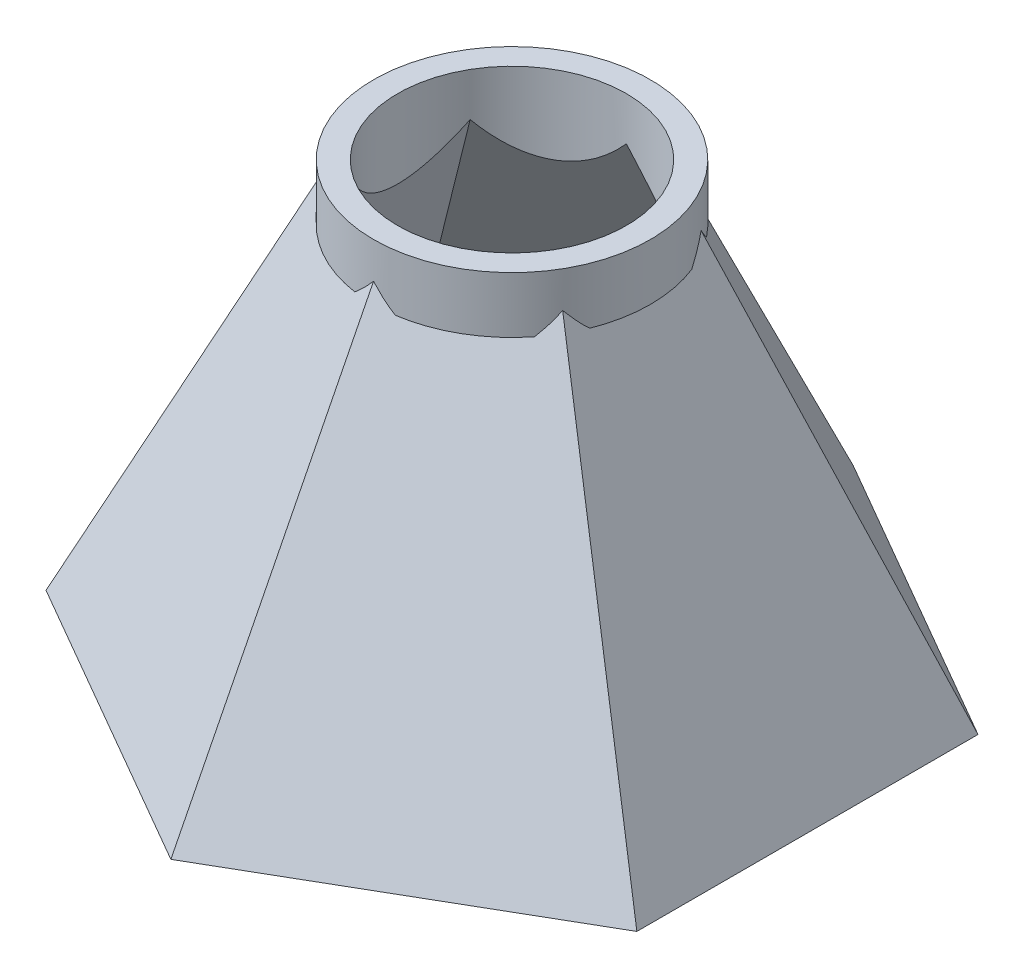
ISO-10303-21;
HEADER;
FILE_DESCRIPTION(('STEP AP214'),'2;1');
FILE_NAME('part.step','',(''),(''),'','','');
FILE_SCHEMA(('AUTOMOTIVE_DESIGN { 1 0 10303 214 1 1 1 1 }'));
ENDSEC;
DATA;
#1=APPLICATION_CONTEXT('core data for automotive mechanical design processes');
#2=APPLICATION_PROTOCOL_DEFINITION('international standard','automotive_design',2000,#1);
#3=PRODUCT_CONTEXT('',#1,'mechanical');
#4=PRODUCT('Part','Part','',(#3));
#5=PRODUCT_RELATED_PRODUCT_CATEGORY('part','',(#4));
#6=PRODUCT_DEFINITION_FORMATION('','',#4);
#7=PRODUCT_DEFINITION_CONTEXT('part definition',#1,'design');
#8=PRODUCT_DEFINITION('design','',#6,#7);
#9=PRODUCT_DEFINITION_SHAPE('','',#8);
#10=(LENGTH_UNIT() NAMED_UNIT(*) SI_UNIT(.MILLI.,.METRE.));
#11=(NAMED_UNIT(*) PLANE_ANGLE_UNIT() SI_UNIT($,.RADIAN.));
#12=(NAMED_UNIT(*) SI_UNIT($,.STERADIAN.) SOLID_ANGLE_UNIT());
#13=UNCERTAINTY_MEASURE_WITH_UNIT(LENGTH_MEASURE(1.E-05),#10,'distance_accuracy_value','');
#14=(GEOMETRIC_REPRESENTATION_CONTEXT(3) GLOBAL_UNCERTAINTY_ASSIGNED_CONTEXT((#13)) GLOBAL_UNIT_ASSIGNED_CONTEXT((#10,
#11,#12)) REPRESENTATION_CONTEXT('',''));
#15=CARTESIAN_POINT('',(0.,0.,0.));
#16=DIRECTION('',(0.,0.,1.));
#17=DIRECTION('',(1.,0.,0.));
#18=AXIS2_PLACEMENT_3D('',#15,#16,#17);
#19=CARTESIAN_POINT('',(-13.1666408178174,55.118,-7.60176362048999));
#20=DIRECTION('',(-0.457729684734172,0.402410415934552,-0.792811070092072));
#21=DIRECTION('',(0.866025403784439,0.,-0.5));
#22=AXIS2_PLACEMENT_3D('',#19,#20,#21);
#23=PLANE('',#22);
#24=CARTESIAN_POINT('',(0.,85.0713119019853,0.));
#25=DIRECTION('',(-0.457729684734172,0.402410415934552,-0.792811070092072));
#26=DIRECTION('',(0.201205207967276,0.915459369468346,0.348497642946785));
#27=AXIS2_PLACEMENT_3D('',#24,#25,#26);
#28=ELLIPSE('',#27,43.5525505951377,17.526);
#29=CARTESIAN_POINT('',(0.,50.5423676594151,-17.526));
#30=VERTEX_POINT('',#29);
#31=CARTESIAN_POINT('',(-2.55384480948767,48.006,-17.3389317055306));
#32=VERTEX_POINT('',#31);
#33=EDGE_CURVE('E399',#30,#32,#28,.T.);
#34=ORIENTED_EDGE('',*,*,#33,.F.);
#35=DIRECTION('',(0.,-0.891709289939976,-0.452608597172815));
#36=VECTOR('',#35,1.);
#37=CARTESIAN_POINT('',(0.,27.559,-29.1917636204902));
#38=LINE('',#37,#36);
#39=CARTESIAN_POINT('',(0.,0.,-43.1800000000004));
#40=VERTEX_POINT('',#39);
#41=EDGE_CURVE('E412',#30,#40,#38,.T.);
#42=ORIENTED_EDGE('',*,*,#41,.T.);
#43=DIRECTION('',(0.866025403784438,0.,-0.500000000000001));
#44=VECTOR('',#43,1.);
#45=CARTESIAN_POINT('',(-18.6974884677062,0.,-32.3850000000003));
#46=LINE('',#45,#44);
#47=CARTESIAN_POINT('',(-37.3949769354125,0.,-21.5900000000001));
#48=VERTEX_POINT('',#47);
#49=EDGE_CURVE('E431',#48,#40,#46,.T.);
#50=ORIENTED_EDGE('',*,*,#49,.F.);
#51=DIRECTION('',(-0.391970543122896,-0.891709289939976,-0.226304298586406));
#52=VECTOR('',#51,1.);
#53=CARTESIAN_POINT('',(-25.2808088766149,27.559,-14.5958818102451));
#54=LINE('',#53,#52);
#55=CARTESIAN_POINT('',(-15.1779612267261,50.5423676594151,-8.763));
#56=VERTEX_POINT('',#55);
#57=EDGE_CURVE('E428',#56,#48,#54,.T.);
#58=ORIENTED_EDGE('',*,*,#57,.F.);
#59=CARTESIAN_POINT('',(-13.7390329267291,48.006,-10.8811603351046));
#60=VERTEX_POINT('',#59);
#61=EDGE_CURVE('E395',#60,#56,#28,.T.);
#62=ORIENTED_EDGE('',*,*,#61,.F.);
#63=DIRECTION('',(0.866025403784439,0.,-0.5));
#64=VECTOR('',#63,1.);
#65=CARTESIAN_POINT('',(-14.7297592770171,48.006,-10.3091642100726));
#66=LINE('',#65,#64);
#67=EDGE_CURVE('E388',#60,#32,#66,.T.);
#68=ORIENTED_EDGE('',*,*,#67,.T.);
#69=EDGE_LOOP('',(#34,#42,#50,#58,#62,#68));
#70=FACE_BOUND('',#69,.T.);
#71=ADVANCED_FACE('F195',(#70),#23,.T.);
#72=CARTESIAN_POINT('',(0.,55.118,-15.20352724098));
#73=DIRECTION('',(0.457729684734172,0.402410415934553,-0.792811070092071));
#74=DIRECTION('',(0.866025403784439,0.,0.5));
#75=AXIS2_PLACEMENT_3D('',#72,#73,#74);
#76=PLANE('',#75);
#77=CARTESIAN_POINT('',(0.,85.0713119019852,0.));
#78=DIRECTION('',(0.457729684734172,0.402410415934553,-0.792811070092071));
#79=DIRECTION('',(-0.201205207967276,0.915459369468345,0.348497642946785));
#80=AXIS2_PLACEMENT_3D('',#77,#78,#79);
#81=ELLIPSE('',#80,43.5525505951376,17.526);
#82=CARTESIAN_POINT('',(15.177961226726,50.5423676594151,-8.76300000000005));
#83=VERTEX_POINT('',#82);
#84=CARTESIAN_POINT('',(13.7390329267291,48.006,-10.8811603351046));
#85=VERTEX_POINT('',#84);
#86=EDGE_CURVE('E408',#83,#85,#81,.T.);
#87=ORIENTED_EDGE('',*,*,#86,.F.);
#88=DIRECTION('',(0.391970543122892,-0.891709289939976,-0.226304298586414));
#89=VECTOR('',#88,1.);
#90=CARTESIAN_POINT('',(25.2808088766148,27.559,-14.5958818102453));
#91=LINE('',#90,#89);
#92=CARTESIAN_POINT('',(37.3949769354122,0.,-21.5900000000006));
#93=VERTEX_POINT('',#92);
#94=EDGE_CURVE('E416',#83,#93,#91,.T.);
#95=ORIENTED_EDGE('',*,*,#94,.T.);
#96=DIRECTION('',(0.866025403784441,0.,0.499999999999995));
#97=VECTOR('',#96,1.);
#98=CARTESIAN_POINT('',(18.6974884677061,0.,-32.3850000000005));
#99=LINE('',#98,#97);
#100=EDGE_CURVE('E435',#40,#93,#99,.T.);
#101=ORIENTED_EDGE('',*,*,#100,.F.);
#102=ORIENTED_EDGE('',*,*,#41,.F.);
#103=CARTESIAN_POINT('',(2.55384480948768,48.006,-17.3389317055306));
#104=VERTEX_POINT('',#103);
#105=EDGE_CURVE('E411',#104,#30,#81,.T.);
#106=ORIENTED_EDGE('',*,*,#105,.F.);
#107=DIRECTION('',(0.866025403784439,0.,0.5));
#108=VECTOR('',#107,1.);
#109=CARTESIAN_POINT('',(1.56311845919968,48.006,-17.9109278305626));
#110=LINE('',#109,#108);
#111=EDGE_CURVE('E384',#104,#85,#110,.T.);
#112=ORIENTED_EDGE('',*,*,#111,.T.);
#113=EDGE_LOOP('',(#87,#95,#101,#102,#106,#112));
#114=FACE_BOUND('',#113,.T.);
#115=ADVANCED_FACE('F513',(#114),#76,.T.);
#116=CARTESIAN_POINT('',(13.1666408178174,55.118,-7.60176362048999));
#117=DIRECTION('',(0.915459369468346,0.40241041593455,0.));
#118=DIRECTION('',(0.,0.,1.));
#119=AXIS2_PLACEMENT_3D('',#116,#117,#118);
#120=PLANE('',#119);
#121=CARTESIAN_POINT('',(0.,85.0713119019855,0.));
#122=DIRECTION('',(0.915459369468346,0.40241041593455,0.));
#123=DIRECTION('',(-0.40241041593455,0.915459369468346,0.));
#124=AXIS2_PLACEMENT_3D('',#121,#122,#123);
#125=ELLIPSE('',#124,43.552550595138,17.526);
#126=CARTESIAN_POINT('',(15.1779612267261,50.5423676594151,8.76299999999998));
#127=VERTEX_POINT('',#126);
#128=CARTESIAN_POINT('',(16.2928777362167,48.006,6.457771370426));
#129=VERTEX_POINT('',#128);
#130=EDGE_CURVE('E404',#127,#129,#125,.T.);
#131=ORIENTED_EDGE('',*,*,#130,.F.);
#132=DIRECTION('',(0.391970543122899,-0.891709289939976,0.226304298586402));
#133=VECTOR('',#132,1.);
#134=CARTESIAN_POINT('',(25.280808876615,27.559,14.5958818102449));
#135=LINE('',#134,#133);
#136=CARTESIAN_POINT('',(37.3949769354126,0.,21.5899999999999));
#137=VERTEX_POINT('',#136);
#138=EDGE_CURVE('E419',#127,#137,#135,.T.);
#139=ORIENTED_EDGE('',*,*,#138,.T.);
#140=DIRECTION('',(0.,0.,1.));
#141=VECTOR('',#140,1.);
#142=CARTESIAN_POINT('',(37.3949769354124,0.,-3.81639164714898E-13));
#143=LINE('',#142,#141);
#144=EDGE_CURVE('E439',#93,#137,#143,.T.);
#145=ORIENTED_EDGE('',*,*,#144,.F.);
#146=ORIENTED_EDGE('',*,*,#94,.F.);
#147=CARTESIAN_POINT('',(16.2928777362167,48.006,-6.45777137042602));
#148=VERTEX_POINT('',#147);
#149=EDGE_CURVE('E407',#148,#83,#125,.T.);
#150=ORIENTED_EDGE('',*,*,#149,.F.);
#151=DIRECTION('',(0.,0.,1.));
#152=VECTOR('',#151,1.);
#153=CARTESIAN_POINT('',(16.2928777362167,48.006,-7.60176362048999));
#154=LINE('',#153,#152);
#155=EDGE_CURVE('E380',#148,#129,#154,.T.);
#156=ORIENTED_EDGE('',*,*,#155,.T.);
#157=EDGE_LOOP('',(#131,#139,#145,#146,#150,#156));
#158=FACE_BOUND('',#157,.T.);
#159=ADVANCED_FACE('F519',(#158),#120,.T.);
#160=CARTESIAN_POINT('',(13.1666408178174,55.118,7.60176362048999));
#161=DIRECTION('',(0.457729684734173,0.40241041593455,0.792811070092073));
#162=DIRECTION('',(-0.866025403784439,0.,0.5));
#163=AXIS2_PLACEMENT_3D('',#160,#161,#162);
#164=PLANE('',#163);
#165=CARTESIAN_POINT('',(0.,85.0713119019855,0.));
#166=DIRECTION('',(0.457729684734173,0.40241041593455,0.792811070092073));
#167=DIRECTION('',(-0.201205207967275,0.915459369468346,-0.348497642946783));
#168=AXIS2_PLACEMENT_3D('',#165,#166,#167);
#169=ELLIPSE('',#168,43.5525505951379,17.526);
#170=CARTESIAN_POINT('',(0.,50.5423676594151,17.526));
#171=VERTEX_POINT('',#170);
#172=CARTESIAN_POINT('',(2.5538448094876,48.006,17.3389317055306));
#173=VERTEX_POINT('',#172);
#174=EDGE_CURVE('E400',#171,#173,#169,.T.);
#175=ORIENTED_EDGE('',*,*,#174,.F.);
#176=DIRECTION('',(0.,-0.891709289939976,0.452608597172815));
#177=VECTOR('',#176,1.);
#178=CARTESIAN_POINT('',(1.50053580671994E-13,27.559,29.1917636204902));
#179=LINE('',#178,#177);
#180=CARTESIAN_POINT('',(2.98372437868011E-13,0.,43.1800000000004));
#181=VERTEX_POINT('',#180);
#182=EDGE_CURVE('E422',#171,#181,#179,.T.);
#183=ORIENTED_EDGE('',*,*,#182,.T.);
#184=DIRECTION('',(-0.866025403784435,0.,0.500000000000007));
#185=VECTOR('',#184,1.);
#186=CARTESIAN_POINT('',(18.6974884677065,0.,32.3850000000001));
#187=LINE('',#186,#185);
#188=EDGE_CURVE('E443',#137,#181,#187,.T.);
#189=ORIENTED_EDGE('',*,*,#188,.F.);
#190=ORIENTED_EDGE('',*,*,#138,.F.);
#191=CARTESIAN_POINT('',(13.7390329267291,48.006,10.8811603351046));
#192=VERTEX_POINT('',#191);
#193=EDGE_CURVE('E403',#192,#127,#169,.T.);
#194=ORIENTED_EDGE('',*,*,#193,.F.);
#195=DIRECTION('',(-0.866025403784439,0.,0.5));
#196=VECTOR('',#195,1.);
#197=CARTESIAN_POINT('',(14.729759277017,48.006,10.3091642100726));
#198=LINE('',#197,#196);
#199=EDGE_CURVE('E376',#192,#173,#198,.T.);
#200=ORIENTED_EDGE('',*,*,#199,.T.);
#201=EDGE_LOOP('',(#175,#183,#189,#190,#194,#200));
#202=FACE_BOUND('',#201,.T.);
#203=ADVANCED_FACE('F528',(#202),#164,.T.);
#204=CARTESIAN_POINT('',(0.,55.118,15.20352724098));
#205=DIRECTION('',(-0.457729684734173,0.402410415934551,0.792811070092072));
#206=DIRECTION('',(-0.866025403784439,0.,-0.5));
#207=AXIS2_PLACEMENT_3D('',#204,#205,#206);
#208=PLANE('',#207);
#209=CARTESIAN_POINT('',(0.,85.0713119019854,0.));
#210=DIRECTION('',(-0.457729684734173,0.402410415934551,0.792811070092072));
#211=DIRECTION('',(0.201205207967275,0.915459369468346,-0.348497642946784));
#212=AXIS2_PLACEMENT_3D('',#209,#210,#211);
#213=ELLIPSE('',#212,43.5525505951378,17.526);
#214=CARTESIAN_POINT('',(-15.1779612267261,50.5423676594151,8.76300000000001));
#215=VERTEX_POINT('',#214);
#216=CARTESIAN_POINT('',(-13.7390329267291,48.006,10.8811603351046));
#217=VERTEX_POINT('',#216);
#218=EDGE_CURVE('E392',#215,#217,#213,.T.);
#219=ORIENTED_EDGE('',*,*,#218,.F.);
#220=DIRECTION('',(-0.391970543122894,-0.891709289939976,0.22630429858641));
#221=VECTOR('',#220,1.);
#222=CARTESIAN_POINT('',(-25.2808088766149,27.559,14.5958818102452));
#223=LINE('',#222,#221);
#224=CARTESIAN_POINT('',(-37.3949769354123,0.,21.5900000000004));
#225=VERTEX_POINT('',#224);
#226=EDGE_CURVE('E425',#215,#225,#223,.T.);
#227=ORIENTED_EDGE('',*,*,#226,.T.);
#228=DIRECTION('',(-0.866025403784441,0.,-0.499999999999995));
#229=VECTOR('',#228,1.);
#230=CARTESIAN_POINT('',(-18.697488467706,0.,32.3850000000004));
#231=LINE('',#230,#229);
#232=EDGE_CURVE('E447',#181,#225,#231,.T.);
#233=ORIENTED_EDGE('',*,*,#232,.F.);
#234=ORIENTED_EDGE('',*,*,#182,.F.);
#235=CARTESIAN_POINT('',(-2.55384480948761,48.006,17.3389317055306));
#236=VERTEX_POINT('',#235);
#237=EDGE_CURVE('E396',#236,#171,#213,.T.);
#238=ORIENTED_EDGE('',*,*,#237,.F.);
#239=DIRECTION('',(-0.866025403784439,0.,-0.5));
#240=VECTOR('',#239,1.);
#241=CARTESIAN_POINT('',(-1.56311845919967,48.006,17.9109278305626));
#242=LINE('',#241,#240);
#243=EDGE_CURVE('E367',#236,#217,#242,.T.);
#244=ORIENTED_EDGE('',*,*,#243,.T.);
#245=EDGE_LOOP('',(#219,#227,#233,#234,#238,#244));
#246=FACE_BOUND('',#245,.T.);
#247=ADVANCED_FACE('F531',(#246),#208,.T.);
#248=CARTESIAN_POINT('',(-13.1666408178174,55.118,7.60176362048998));
#249=DIRECTION('',(-0.915459369468346,0.402410415934552,0.));
#250=DIRECTION('',(0.,0.,-1.));
#251=AXIS2_PLACEMENT_3D('',#248,#249,#250);
#252=PLANE('',#251);
#253=CARTESIAN_POINT('',(0.,85.0713119019853,0.));
#254=DIRECTION('',(-0.915459369468346,0.402410415934552,0.));
#255=DIRECTION('',(0.402410415934552,0.915459369468346,0.));
#256=AXIS2_PLACEMENT_3D('',#253,#254,#255);
#257=ELLIPSE('',#256,43.5525505951377,17.526);
#258=CARTESIAN_POINT('',(-16.2928777362167,48.006,-6.45777137042595));
#259=VERTEX_POINT('',#258);
#260=EDGE_CURVE('E461',#56,#259,#257,.T.);
#261=ORIENTED_EDGE('',*,*,#260,.F.);
#262=ORIENTED_EDGE('',*,*,#57,.T.);
#263=DIRECTION('',(0.,0.,-1.));
#264=VECTOR('',#263,1.);
#265=CARTESIAN_POINT('',(-37.3949769354124,0.,1.21430643318376E-13));
#266=LINE('',#265,#264);
#267=EDGE_CURVE('E451',#225,#48,#266,.T.);
#268=ORIENTED_EDGE('',*,*,#267,.F.);
#269=ORIENTED_EDGE('',*,*,#226,.F.);
#270=CARTESIAN_POINT('',(-16.2928777362167,48.006,6.45777137042596));
#271=VERTEX_POINT('',#270);
#272=EDGE_CURVE('E458',#271,#215,#257,.T.);
#273=ORIENTED_EDGE('',*,*,#272,.F.);
#274=DIRECTION('',(0.,0.,-1.));
#275=VECTOR('',#274,1.);
#276=CARTESIAN_POINT('',(-16.2928777362167,48.006,7.60176362048999));
#277=LINE('',#276,#275);
#278=EDGE_CURVE('E415',#271,#259,#277,.T.);
#279=ORIENTED_EDGE('',*,*,#278,.T.);
#280=EDGE_LOOP('',(#261,#262,#268,#269,#273,#279));
#281=FACE_BOUND('',#280,.T.);
#282=ADVANCED_FACE('F197',(#281),#252,.T.);
#283=CARTESIAN_POINT('',(0.,0.,0.));
#284=DIRECTION('',(0.,-1.,0.));
#285=DIRECTION('',(0.,0.,-1.));
#286=AXIS2_PLACEMENT_3D('',#283,#284,#285);
#287=PLANE('',#286);
#288=DIRECTION('',(0.,0.,-1.));
#289=VECTOR('',#288,1.);
#290=CARTESIAN_POINT('',(-34.3469769354121,0.,0.));
#291=LINE('',#290,#289);
#292=CARTESIAN_POINT('',(-34.3469769354121,0.,19.83023637951));
#293=VERTEX_POINT('',#292);
#294=CARTESIAN_POINT('',(-34.3469769354121,0.,-19.83023637951));
#295=VERTEX_POINT('',#294);
#296=EDGE_CURVE('E324',#293,#295,#291,.T.);
#297=ORIENTED_EDGE('',*,*,#296,.F.);
#298=DIRECTION('',(-0.866025403784439,0.,-0.5));
#299=VECTOR('',#298,1.);
#300=CARTESIAN_POINT('',(-17.173488467706,0.,29.745354569265));
#301=LINE('',#300,#299);
#302=CARTESIAN_POINT('',(0.,0.,39.6604727590201));
#303=VERTEX_POINT('',#302);
#304=EDGE_CURVE('E331',#303,#293,#301,.T.);
#305=ORIENTED_EDGE('',*,*,#304,.F.);
#306=DIRECTION('',(-0.866025403784439,0.,0.5));
#307=VECTOR('',#306,1.);
#308=CARTESIAN_POINT('',(17.173488467706,0.,29.745354569265));
#309=LINE('',#308,#307);
#310=CARTESIAN_POINT('',(34.3469769354121,0.,19.83023637951));
#311=VERTEX_POINT('',#310);
#312=EDGE_CURVE('E211',#311,#303,#309,.T.);
#313=ORIENTED_EDGE('',*,*,#312,.F.);
#314=DIRECTION('',(0.,0.,1.));
#315=VECTOR('',#314,1.);
#316=CARTESIAN_POINT('',(34.3469769354121,0.,0.));
#317=LINE('',#316,#315);
#318=CARTESIAN_POINT('',(34.346976935412,0.,-19.8302363795101));
#319=VERTEX_POINT('',#318);
#320=EDGE_CURVE('E351',#319,#311,#317,.T.);
#321=ORIENTED_EDGE('',*,*,#320,.F.);
#322=DIRECTION('',(0.866025403784439,0.,0.5));
#323=VECTOR('',#322,1.);
#324=CARTESIAN_POINT('',(17.173488467706,0.,-29.7453545692651));
#325=LINE('',#324,#323);
#326=CARTESIAN_POINT('',(0.,0.,-39.6604727590201));
#327=VERTEX_POINT('',#326);
#328=EDGE_CURVE('E344',#327,#319,#325,.T.);
#329=ORIENTED_EDGE('',*,*,#328,.F.);
#330=DIRECTION('',(0.866025403784439,0.,-0.5));
#331=VECTOR('',#330,1.);
#332=CARTESIAN_POINT('',(-17.173488467706,0.,-29.745354569265));
#333=LINE('',#332,#331);
#334=EDGE_CURVE('E340',#295,#327,#333,.T.);
#335=ORIENTED_EDGE('',*,*,#334,.F.);
#336=EDGE_LOOP('',(#297,#305,#313,#321,#329,#335));
#337=FACE_BOUND('',#336,.T.);
#338=ORIENTED_EDGE('',*,*,#49,.T.);
#339=ORIENTED_EDGE('',*,*,#100,.T.);
#340=ORIENTED_EDGE('',*,*,#144,.T.);
#341=ORIENTED_EDGE('',*,*,#188,.T.);
#342=ORIENTED_EDGE('',*,*,#232,.T.);
#343=ORIENTED_EDGE('',*,*,#267,.T.);
#344=EDGE_LOOP('',(#338,#339,#340,#341,#342,#343));
#345=FACE_BOUND('',#344,.T.);
#346=ADVANCED_FACE('F336',(#337,#345),#287,.T.);
#347=CARTESIAN_POINT('',(0.,48.006,0.));
#348=DIRECTION('',(0.,1.,0.));
#349=DIRECTION('',(0.,0.,1.));
#350=AXIS2_PLACEMENT_3D('',#347,#348,#349);
#351=PLANE('',#350);
#352=ORIENTED_EDGE('',*,*,#67,.F.);
#353=CARTESIAN_POINT('',(0.,48.006,0.));
#354=DIRECTION('',(0.,1.,0.));
#355=DIRECTION('',(0.,0.,1.));
#356=AXIS2_PLACEMENT_3D('',#353,#354,#355);
#357=CIRCLE('',#356,17.526);
#358=EDGE_CURVE('E723',#32,#60,#357,.T.);
#359=ORIENTED_EDGE('',*,*,#358,.F.);
#360=EDGE_LOOP('',(#352,#359));
#361=FACE_BOUND('',#360,.T.);
#362=ADVANCED_FACE('F578',(#361),#351,.F.);
#363=ORIENTED_EDGE('',*,*,#111,.F.);
#364=EDGE_CURVE('E727',#85,#104,#357,.T.);
#365=ORIENTED_EDGE('',*,*,#364,.F.);
#366=EDGE_LOOP('',(#363,#365));
#367=FACE_BOUND('',#366,.T.);
#368=ADVANCED_FACE('F571',(#367),#351,.F.);
#369=ORIENTED_EDGE('',*,*,#155,.F.);
#370=EDGE_CURVE('E368',#129,#148,#357,.T.);
#371=ORIENTED_EDGE('',*,*,#370,.F.);
#372=EDGE_LOOP('',(#369,#371));
#373=FACE_BOUND('',#372,.T.);
#374=ADVANCED_FACE('F563',(#373),#351,.F.);
#375=ORIENTED_EDGE('',*,*,#199,.F.);
#376=EDGE_CURVE('E363',#173,#192,#357,.T.);
#377=ORIENTED_EDGE('',*,*,#376,.F.);
#378=EDGE_LOOP('',(#375,#377));
#379=FACE_BOUND('',#378,.T.);
#380=ADVANCED_FACE('F560',(#379),#351,.F.);
#381=ORIENTED_EDGE('',*,*,#243,.F.);
#382=EDGE_CURVE('E369',#217,#236,#357,.T.);
#383=ORIENTED_EDGE('',*,*,#382,.F.);
#384=EDGE_LOOP('',(#381,#383));
#385=FACE_BOUND('',#384,.T.);
#386=ADVANCED_FACE('F562',(#385),#351,.F.);
#387=CARTESIAN_POINT('',(0.,48.006,0.));
#388=DIRECTION('',(0.,1.,0.));
#389=DIRECTION('',(0.,0.,1.));
#390=AXIS2_PLACEMENT_3D('',#387,#388,#389);
#391=CYLINDRICAL_SURFACE('',#390,17.526);
#392=ORIENTED_EDGE('',*,*,#105,.T.);
#393=ORIENTED_EDGE('',*,*,#33,.T.);
#394=ORIENTED_EDGE('',*,*,#358,.T.);
#395=ORIENTED_EDGE('',*,*,#61,.T.);
#396=ORIENTED_EDGE('',*,*,#260,.T.);
#397=EDGE_CURVE('E728',#259,#271,#357,.T.);
#398=ORIENTED_EDGE('',*,*,#397,.T.);
#399=ORIENTED_EDGE('',*,*,#272,.T.);
#400=ORIENTED_EDGE('',*,*,#218,.T.);
#401=ORIENTED_EDGE('',*,*,#382,.T.);
#402=ORIENTED_EDGE('',*,*,#237,.T.);
#403=ORIENTED_EDGE('',*,*,#174,.T.);
#404=ORIENTED_EDGE('',*,*,#376,.T.);
#405=ORIENTED_EDGE('',*,*,#193,.T.);
#406=ORIENTED_EDGE('',*,*,#130,.T.);
#407=ORIENTED_EDGE('',*,*,#370,.T.);
#408=ORIENTED_EDGE('',*,*,#149,.T.);
#409=ORIENTED_EDGE('',*,*,#86,.T.);
#410=ORIENTED_EDGE('',*,*,#364,.T.);
#411=EDGE_LOOP('',(#392,#393,#394,#395,#396,#398,#399,#400,#401,#402,#403,#404,#405,#406,#407,
#408,#409,#410));
#412=FACE_BOUND('',#411,.T.);
#413=CARTESIAN_POINT('',(0.,55.118,0.));
#414=DIRECTION('',(0.,1.,0.));
#415=DIRECTION('',(0.,0.,1.));
#416=AXIS2_PLACEMENT_3D('',#413,#414,#415);
#417=CIRCLE('',#416,17.526);
#418=CARTESIAN_POINT('',(0.,55.118,17.526));
#419=VERTEX_POINT('',#418);
#420=EDGE_CURVE('E361',#419,#419,#417,.T.);
#421=ORIENTED_EDGE('',*,*,#420,.F.);
#422=EDGE_LOOP('',(#421));
#423=FACE_BOUND('',#422,.T.);
#424=ADVANCED_FACE('F557',(#412,#423),#391,.T.);
#425=ORIENTED_EDGE('',*,*,#278,.F.);
#426=ORIENTED_EDGE('',*,*,#397,.F.);
#427=EDGE_LOOP('',(#425,#426));
#428=FACE_BOUND('',#427,.T.);
#429=ADVANCED_FACE('F570',(#428),#351,.F.);
#430=CARTESIAN_POINT('',(0.,55.118,0.));
#431=DIRECTION('',(0.,-1.,0.));
#432=DIRECTION('',(0.,0.,-1.));
#433=AXIS2_PLACEMENT_3D('',#430,#431,#432);
#434=PLANE('',#433);
#435=CARTESIAN_POINT('',(0.,55.118,0.));
#436=DIRECTION('',(0.,1.,0.));
#437=DIRECTION('',(0.,0.,1.));
#438=AXIS2_PLACEMENT_3D('',#435,#436,#437);
#439=CIRCLE('',#438,14.478);
#440=CARTESIAN_POINT('',(0.,55.118,14.478));
#441=VERTEX_POINT('',#440);
#442=EDGE_CURVE('E357',#441,#441,#439,.T.);
#443=ORIENTED_EDGE('',*,*,#442,.F.);
#444=EDGE_LOOP('',(#443));
#445=FACE_BOUND('',#444,.T.);
#446=ORIENTED_EDGE('',*,*,#420,.T.);
#447=EDGE_LOOP('',(#446));
#448=FACE_BOUND('',#447,.T.);
#449=ADVANCED_FACE('F576',(#445,#448),#434,.F.);
#450=CARTESIAN_POINT('',(0.,-0.001000000000001,0.));
#451=DIRECTION('',(0.,1.,0.));
#452=DIRECTION('',(0.,0.,1.));
#453=AXIS2_PLACEMENT_3D('',#450,#451,#452);
#454=CYLINDRICAL_SURFACE('',#453,14.478);
#455=CARTESIAN_POINT('',(0.,78.1372961617136,0.));
#456=DIRECTION('',(-0.457729684734169,0.40241041593455,0.792811070092075));
#457=DIRECTION('',(0.201205207967273,0.915459369468347,-0.348497642946784));
#458=AXIS2_PLACEMENT_3D('',#455,#456,#457);
#459=ELLIPSE('',#458,35.9781939698966,14.478);
#460=CARTESIAN_POINT('',(0.,49.6133857004597,14.478));
#461=VERTEX_POINT('',#460);
#462=CARTESIAN_POINT('',(-12.5383157959911,49.6133857004597,7.23900000000004));
#463=VERTEX_POINT('',#462);
#464=EDGE_CURVE('E462',#461,#463,#459,.F.);
#465=ORIENTED_EDGE('',*,*,#464,.T.);
#466=CARTESIAN_POINT('',(0.,78.1372961617136,0.));
#467=DIRECTION('',(-0.915459369468347,0.402410415934549,0.));
#468=DIRECTION('',(0.402410415934549,0.915459369468347,0.));
#469=AXIS2_PLACEMENT_3D('',#466,#467,#468);
#470=ELLIPSE('',#469,35.9781939698966,14.478);
#471=CARTESIAN_POINT('',(-12.5383157959911,49.6133857004597,-7.23899999999998));
#472=VERTEX_POINT('',#471);
#473=EDGE_CURVE('E12',#463,#472,#470,.F.);
#474=ORIENTED_EDGE('',*,*,#473,.T.);
#475=CARTESIAN_POINT('',(0.,78.1372961617136,0.));
#476=DIRECTION('',(-0.457729684734174,0.402410415934549,-0.792811070092072));
#477=DIRECTION('',(0.201205207967275,0.915459369468347,0.348497642946781));
#478=AXIS2_PLACEMENT_3D('',#475,#476,#477);
#479=ELLIPSE('',#478,35.9781939698967,14.478);
#480=CARTESIAN_POINT('',(0.,49.6133857004597,-14.478));
#481=VERTEX_POINT('',#480);
#482=EDGE_CURVE('E204',#472,#481,#479,.F.);
#483=ORIENTED_EDGE('',*,*,#482,.T.);
#484=CARTESIAN_POINT('',(0.,78.1372961617137,0.));
#485=DIRECTION('',(0.457729684734169,0.40241041593455,-0.792811070092075));
#486=DIRECTION('',(-0.201205207967273,0.915459369468347,0.348497642946783));
#487=AXIS2_PLACEMENT_3D('',#484,#485,#486);
#488=ELLIPSE('',#487,35.9781939698966,14.478);
#489=CARTESIAN_POINT('',(12.538315795991,49.6133857004597,-7.23900000000011));
#490=VERTEX_POINT('',#489);
#491=EDGE_CURVE('E473',#481,#490,#488,.F.);
#492=ORIENTED_EDGE('',*,*,#491,.T.);
#493=CARTESIAN_POINT('',(0.,78.1372961617135,0.));
#494=DIRECTION('',(0.915459369468346,0.402410415934551,0.));
#495=DIRECTION('',(-0.402410415934551,0.915459369468346,0.));
#496=AXIS2_PLACEMENT_3D('',#493,#494,#495);
#497=ELLIPSE('',#496,35.9781939698965,14.478);
#498=CARTESIAN_POINT('',(12.5383157959912,49.6133857004597,7.23899999999992));
#499=VERTEX_POINT('',#498);
#500=EDGE_CURVE('E469',#490,#499,#497,.F.);
#501=ORIENTED_EDGE('',*,*,#500,.T.);
#502=CARTESIAN_POINT('',(0.,78.1372961617135,0.));
#503=DIRECTION('',(0.45772968473418,0.402410415934551,0.792811070092068));
#504=DIRECTION('',(-0.201205207967278,0.915459369468346,-0.348497642946782));
#505=AXIS2_PLACEMENT_3D('',#502,#503,#504);
#506=ELLIPSE('',#505,35.9781939698965,14.478);
#507=EDGE_CURVE('E465',#499,#461,#506,.F.);
#508=ORIENTED_EDGE('',*,*,#507,.T.);
#509=EDGE_LOOP('',(#465,#474,#483,#492,#501,#508));
#510=FACE_BOUND('',#509,.T.);
#511=ORIENTED_EDGE('',*,*,#442,.T.);
#512=EDGE_LOOP('',(#511));
#513=FACE_BOUND('',#512,.T.);
#514=ADVANCED_FACE('F479',(#510,#513),#454,.F.);
#515=CARTESIAN_POINT('',(-10.1186408178173,55.118,5.84200000000003));
#516=DIRECTION('',(-0.915459369468347,0.402410415934549,0.));
#517=DIRECTION('',(0.,0.,-1.));
#518=AXIS2_PLACEMENT_3D('',#515,#516,#517);
#519=PLANE('',#518);
#520=DIRECTION('',(-0.391970543122891,-0.891709289939979,0.226304298586404));
#521=VECTOR('',#520,1.);
#522=CARTESIAN_POINT('',(-22.2328088766147,27.559,12.836118189755));
#523=LINE('',#522,#521);
#524=EDGE_CURVE('E219',#463,#293,#523,.T.);
#525=ORIENTED_EDGE('',*,*,#524,.T.);
#526=ORIENTED_EDGE('',*,*,#296,.T.);
#527=DIRECTION('',(-0.391970543122891,-0.891709289939979,-0.226304298586406));
#528=VECTOR('',#527,1.);
#529=CARTESIAN_POINT('',(-22.2328088766147,27.559,-12.836118189755));
#530=LINE('',#529,#528);
#531=EDGE_CURVE('E362',#472,#295,#530,.T.);
#532=ORIENTED_EDGE('',*,*,#531,.F.);
#533=ORIENTED_EDGE('',*,*,#473,.F.);
#534=EDGE_LOOP('',(#525,#526,#532,#533));
#535=FACE_BOUND('',#534,.T.);
#536=ADVANCED_FACE('F321',(#535),#519,.F.);
#537=CARTESIAN_POINT('',(-10.1186408178174,55.118,-5.84199999999996));
#538=DIRECTION('',(-0.457729684734174,0.402410415934549,-0.792811070092072));
#539=DIRECTION('',(0.866025403784438,0.,-0.500000000000001));
#540=AXIS2_PLACEMENT_3D('',#537,#538,#539);
#541=PLANE('',#540);
#542=ORIENTED_EDGE('',*,*,#531,.T.);
#543=ORIENTED_EDGE('',*,*,#334,.T.);
#544=DIRECTION('',(0.,-0.891709289939979,-0.45260859717281));
#545=VECTOR('',#544,1.);
#546=CARTESIAN_POINT('',(0.,27.559,-25.67223637951));
#547=LINE('',#546,#545);
#548=EDGE_CURVE('E484',#481,#327,#547,.T.);
#549=ORIENTED_EDGE('',*,*,#548,.F.);
#550=ORIENTED_EDGE('',*,*,#482,.F.);
#551=EDGE_LOOP('',(#542,#543,#549,#550));
#552=FACE_BOUND('',#551,.T.);
#553=ADVANCED_FACE('F483',(#552),#541,.F.);
#554=CARTESIAN_POINT('',(0.,55.118,-11.684));
#555=DIRECTION('',(0.457729684734169,0.40241041593455,-0.792811070092075));
#556=DIRECTION('',(0.866025403784441,0.,0.499999999999995));
#557=AXIS2_PLACEMENT_3D('',#554,#555,#556);
#558=PLANE('',#557);
#559=ORIENTED_EDGE('',*,*,#548,.T.);
#560=ORIENTED_EDGE('',*,*,#328,.T.);
#561=DIRECTION('',(0.391970543122892,-0.891709289939979,-0.226304298586404));
#562=VECTOR('',#561,1.);
#563=CARTESIAN_POINT('',(22.2328088766147,27.559,-12.8361181897551));
#564=LINE('',#563,#562);
#565=EDGE_CURVE('E488',#490,#319,#564,.T.);
#566=ORIENTED_EDGE('',*,*,#565,.F.);
#567=ORIENTED_EDGE('',*,*,#491,.F.);
#568=EDGE_LOOP('',(#559,#560,#566,#567));
#569=FACE_BOUND('',#568,.T.);
#570=ADVANCED_FACE('F503',(#569),#558,.F.);
#571=CARTESIAN_POINT('',(10.1186408178173,55.118,-5.84200000000011));
#572=DIRECTION('',(0.915459369468346,0.402410415934551,0.));
#573=DIRECTION('',(0.,0.,1.));
#574=AXIS2_PLACEMENT_3D('',#571,#572,#573);
#575=PLANE('',#574);
#576=ORIENTED_EDGE('',*,*,#565,.T.);
#577=ORIENTED_EDGE('',*,*,#320,.T.);
#578=DIRECTION('',(0.39197054312289,-0.891709289939979,0.226304298586407));
#579=VECTOR('',#578,1.);
#580=CARTESIAN_POINT('',(22.2328088766147,27.559,12.836118189755));
#581=LINE('',#580,#579);
#582=EDGE_CURVE('E493',#499,#311,#581,.T.);
#583=ORIENTED_EDGE('',*,*,#582,.F.);
#584=ORIENTED_EDGE('',*,*,#500,.F.);
#585=EDGE_LOOP('',(#576,#577,#583,#584));
#586=FACE_BOUND('',#585,.T.);
#587=ADVANCED_FACE('F500',(#586),#575,.F.);
#588=CARTESIAN_POINT('',(10.1186408178174,55.118,5.84199999999989));
#589=DIRECTION('',(0.45772968473418,0.402410415934551,0.792811070092068));
#590=DIRECTION('',(-0.866025403784434,0.,0.500000000000007));
#591=AXIS2_PLACEMENT_3D('',#588,#589,#590);
#592=PLANE('',#591);
#593=ORIENTED_EDGE('',*,*,#582,.T.);
#594=ORIENTED_EDGE('',*,*,#312,.T.);
#595=DIRECTION('',(0.,-0.891709289939979,0.45260859717281));
#596=VECTOR('',#595,1.);
#597=CARTESIAN_POINT('',(0.,27.559,25.67223637951));
#598=LINE('',#597,#596);
#599=EDGE_CURVE('E328',#461,#303,#598,.T.);
#600=ORIENTED_EDGE('',*,*,#599,.F.);
#601=ORIENTED_EDGE('',*,*,#507,.F.);
#602=EDGE_LOOP('',(#593,#594,#600,#601));
#603=FACE_BOUND('',#602,.T.);
#604=ADVANCED_FACE('F497',(#603),#592,.F.);
#605=CARTESIAN_POINT('',(0.,55.118,11.684));
#606=DIRECTION('',(-0.457729684734169,0.40241041593455,0.792811070092075));
#607=DIRECTION('',(-0.866025403784441,0.,-0.499999999999995));
#608=AXIS2_PLACEMENT_3D('',#605,#606,#607);
#609=PLANE('',#608);
#610=ORIENTED_EDGE('',*,*,#599,.T.);
#611=ORIENTED_EDGE('',*,*,#304,.T.);
#612=ORIENTED_EDGE('',*,*,#524,.F.);
#613=ORIENTED_EDGE('',*,*,#464,.F.);
#614=EDGE_LOOP('',(#610,#611,#612,#613));
#615=FACE_BOUND('',#614,.T.);
#616=ADVANCED_FACE('F332',(#615),#609,.F.);
#617=CLOSED_SHELL('',(#71,#115,#159,#203,#247,#282,#346,#362,#368,#374,#380,#386,#424,#429,#449,
#514,#536,#553,#570,#587,#604,#616));
#618=MANIFOLD_SOLID_BREP('B2',#617);
#619=ADVANCED_BREP_SHAPE_REPRESENTATION('',(#18,#618),#14);
#620=SHAPE_DEFINITION_REPRESENTATION(#9,#619);
ENDSEC;
END-ISO-10303-21;
